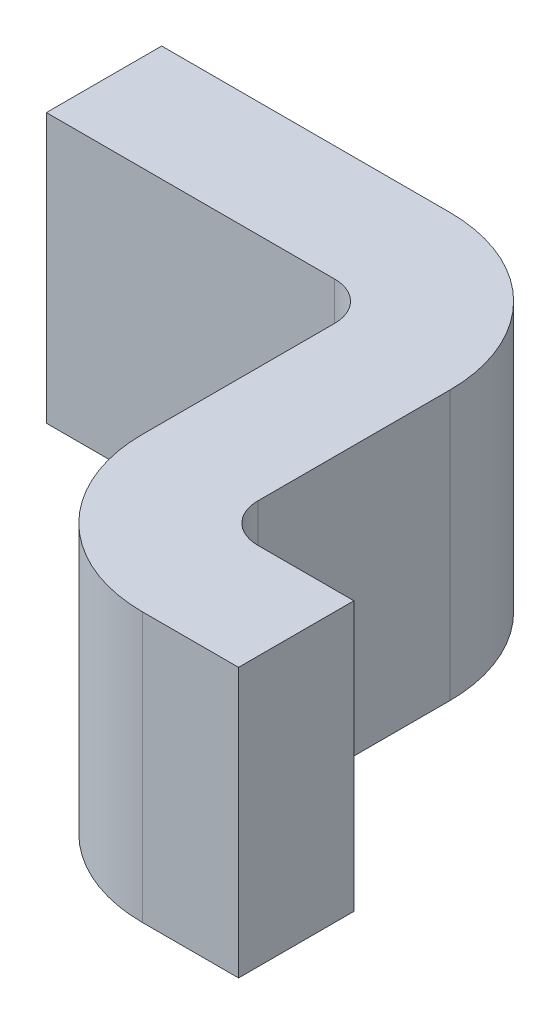
ISO-10303-21;
HEADER;
FILE_DESCRIPTION(('STEP AP214'),'2;1');
FILE_NAME('part.step','',(''),(''),'','','');
FILE_SCHEMA(('AUTOMOTIVE_DESIGN { 1 0 10303 214 1 1 1 1 }'));
ENDSEC;
DATA;
#1=APPLICATION_CONTEXT('core data for automotive mechanical design processes');
#2=APPLICATION_PROTOCOL_DEFINITION('international standard','automotive_design',2000,#1);
#3=PRODUCT_CONTEXT('',#1,'mechanical');
#4=PRODUCT('Part','Part','',(#3));
#5=PRODUCT_RELATED_PRODUCT_CATEGORY('part','',(#4));
#6=PRODUCT_DEFINITION_FORMATION('','',#4);
#7=PRODUCT_DEFINITION_CONTEXT('part definition',#1,'design');
#8=PRODUCT_DEFINITION('design','',#6,#7);
#9=PRODUCT_DEFINITION_SHAPE('','',#8);
#10=(LENGTH_UNIT() NAMED_UNIT(*) SI_UNIT(.MILLI.,.METRE.));
#11=(NAMED_UNIT(*) PLANE_ANGLE_UNIT() SI_UNIT($,.RADIAN.));
#12=(NAMED_UNIT(*) SI_UNIT($,.STERADIAN.) SOLID_ANGLE_UNIT());
#13=UNCERTAINTY_MEASURE_WITH_UNIT(LENGTH_MEASURE(1.E-05),#10,'distance_accuracy_value','');
#14=(GEOMETRIC_REPRESENTATION_CONTEXT(3) GLOBAL_UNCERTAINTY_ASSIGNED_CONTEXT((#13)) GLOBAL_UNIT_ASSIGNED_CONTEXT((#10,
#11,#12)) REPRESENTATION_CONTEXT('',''));
#15=CARTESIAN_POINT('',(0.,0.,0.));
#16=DIRECTION('',(0.,0.,1.));
#17=DIRECTION('',(1.,0.,0.));
#18=AXIS2_PLACEMENT_3D('',#15,#16,#17);
#19=CARTESIAN_POINT('',(-4.075,1.8917811708335,0.));
#20=DIRECTION('',(0.,-1.,0.));
#21=DIRECTION('',(0.,0.,-1.));
#22=AXIS2_PLACEMENT_3D('',#19,#20,#21);
#23=PLANE('',#22);
#24=DIRECTION('',(-1.,0.,0.));
#25=VECTOR('',#24,1.);
#26=CARTESIAN_POINT('',(0.,1.8917811708335,0.));
#27=LINE('',#26,#25);
#28=CARTESIAN_POINT('',(-3.75,1.8917811708335,0.));
#29=VERTEX_POINT('',#28);
#30=CARTESIAN_POINT('',(-4.5,1.8917811708335,0.));
#31=VERTEX_POINT('',#30);
#32=EDGE_CURVE('E134',#29,#31,#27,.T.);
#33=ORIENTED_EDGE('',*,*,#32,.F.);
#34=CARTESIAN_POINT('',(-3.75,1.8917811708335,0.4));
#35=DIRECTION('',(0.,1.,0.));
#36=DIRECTION('',(0.,0.,1.));
#37=AXIS2_PLACEMENT_3D('',#34,#35,#36);
#38=CIRCLE('',#37,0.4);
#39=CARTESIAN_POINT('',(-3.35,1.8917811708335,0.4));
#40=VERTEX_POINT('',#39);
#41=EDGE_CURVE('E182',#40,#29,#38,.T.);
#42=ORIENTED_EDGE('',*,*,#41,.F.);
#43=DIRECTION('',(0.,0.,-1.));
#44=VECTOR('',#43,1.);
#45=CARTESIAN_POINT('',(-3.35,1.8917811708335,0.));
#46=LINE('',#45,#44);
#47=CARTESIAN_POINT('',(-3.35,1.8917811708335,0.9));
#48=VERTEX_POINT('',#47);
#49=EDGE_CURVE('E140',#48,#40,#46,.T.);
#50=ORIENTED_EDGE('',*,*,#49,.F.);
#51=CARTESIAN_POINT('',(-3.25,1.8917811708335,0.9));
#52=DIRECTION('',(0.,-1.,0.));
#53=DIRECTION('',(0.,0.,-1.));
#54=AXIS2_PLACEMENT_3D('',#51,#52,#53);
#55=CIRCLE('',#54,0.1);
#56=CARTESIAN_POINT('',(-3.25,1.8917811708335,1.));
#57=VERTEX_POINT('',#56);
#58=EDGE_CURVE('E185',#48,#57,#55,.F.);
#59=ORIENTED_EDGE('',*,*,#58,.T.);
#60=DIRECTION('',(1.,0.,0.));
#61=VECTOR('',#60,1.);
#62=CARTESIAN_POINT('',(-3.5,1.8917811708335,1.));
#63=LINE('',#62,#61);
#64=CARTESIAN_POINT('',(-3.,1.8917811708335,1.));
#65=VERTEX_POINT('',#64);
#66=EDGE_CURVE('E144',#57,#65,#63,.T.);
#67=ORIENTED_EDGE('',*,*,#66,.T.);
#68=DIRECTION('',(0.,0.,-1.));
#69=VECTOR('',#68,1.);
#70=CARTESIAN_POINT('',(-3.,1.8917811708335,1.));
#71=LINE('',#70,#69);
#72=CARTESIAN_POINT('',(-3.,1.8917811708335,1.3));
#73=VERTEX_POINT('',#72);
#74=EDGE_CURVE('E148',#73,#65,#71,.T.);
#75=ORIENTED_EDGE('',*,*,#74,.F.);
#76=DIRECTION('',(1.,0.,0.));
#77=VECTOR('',#76,1.);
#78=CARTESIAN_POINT('',(-3.65,1.8917811708335,1.3));
#79=LINE('',#78,#77);
#80=CARTESIAN_POINT('',(-3.25,1.8917811708335,1.3));
#81=VERTEX_POINT('',#80);
#82=EDGE_CURVE('E156',#81,#73,#79,.T.);
#83=ORIENTED_EDGE('',*,*,#82,.F.);
#84=CARTESIAN_POINT('',(-3.25,1.8917811708335,0.9));
#85=DIRECTION('',(0.,1.,0.));
#86=DIRECTION('',(0.,0.,1.));
#87=AXIS2_PLACEMENT_3D('',#84,#85,#86);
#88=CIRCLE('',#87,0.4);
#89=CARTESIAN_POINT('',(-3.65,1.8917811708335,0.9));
#90=VERTEX_POINT('',#89);
#91=EDGE_CURVE('E187',#90,#81,#88,.T.);
#92=ORIENTED_EDGE('',*,*,#91,.F.);
#93=DIRECTION('',(0.,0.,-1.));
#94=VECTOR('',#93,1.);
#95=CARTESIAN_POINT('',(-3.65,1.8917811708335,0.15));
#96=LINE('',#95,#94);
#97=CARTESIAN_POINT('',(-3.65,1.8917811708335,0.4));
#98=VERTEX_POINT('',#97);
#99=EDGE_CURVE('E162',#90,#98,#96,.T.);
#100=ORIENTED_EDGE('',*,*,#99,.T.);
#101=CARTESIAN_POINT('',(-3.75,1.8917811708335,0.4));
#102=DIRECTION('',(0.,1.,0.));
#103=DIRECTION('',(0.,0.,1.));
#104=AXIS2_PLACEMENT_3D('',#101,#102,#103);
#105=CIRCLE('',#104,0.1);
#106=CARTESIAN_POINT('',(-3.75,1.8917811708335,0.3));
#107=VERTEX_POINT('',#106);
#108=EDGE_CURVE('E20',#98,#107,#105,.T.);
#109=ORIENTED_EDGE('',*,*,#108,.T.);
#110=DIRECTION('',(-1.,0.,0.));
#111=VECTOR('',#110,1.);
#112=CARTESIAN_POINT('',(0.,1.8917811708335,0.3));
#113=LINE('',#112,#111);
#114=CARTESIAN_POINT('',(-4.5,1.8917811708335,0.3));
#115=VERTEX_POINT('',#114);
#116=EDGE_CURVE('E92',#107,#115,#113,.T.);
#117=ORIENTED_EDGE('',*,*,#116,.T.);
#118=DIRECTION('',(0.,0.,1.));
#119=VECTOR('',#118,1.);
#120=CARTESIAN_POINT('',(-4.5,1.8917811708335,0.));
#121=LINE('',#120,#119);
#122=EDGE_CURVE('E112',#31,#115,#121,.T.);
#123=ORIENTED_EDGE('',*,*,#122,.F.);
#124=EDGE_LOOP('',(#33,#42,#50,#59,#67,#75,#83,#92,#100,#109,#117,#123));
#125=FACE_BOUND('',#124,.T.);
#126=ADVANCED_FACE('F17',(#125),#23,.T.);
#127=CARTESIAN_POINT('',(0.,0.,0.));
#128=DIRECTION('',(0.,0.,-1.));
#129=DIRECTION('',(-1.,0.,0.));
#130=AXIS2_PLACEMENT_3D('',#127,#128,#129);
#131=PLANE('',#130);
#132=DIRECTION('',(0.,1.,0.));
#133=VECTOR('',#132,1.);
#134=CARTESIAN_POINT('',(-4.5,2.2417811708335,0.));
#135=LINE('',#134,#133);
#136=CARTESIAN_POINT('',(-4.5,2.5917811708335,0.));
#137=VERTEX_POINT('',#136);
#138=EDGE_CURVE('E101',#137,#31,#135,.F.);
#139=ORIENTED_EDGE('',*,*,#138,.F.);
#140=DIRECTION('',(1.,0.,0.));
#141=VECTOR('',#140,1.);
#142=CARTESIAN_POINT('',(-4.075,2.5917811708335,0.));
#143=LINE('',#142,#141);
#144=CARTESIAN_POINT('',(-3.75,2.5917811708335,0.));
#145=VERTEX_POINT('',#144);
#146=EDGE_CURVE('E125',#145,#137,#143,.F.);
#147=ORIENTED_EDGE('',*,*,#146,.F.);
#148=DIRECTION('',(0.,1.,0.));
#149=VECTOR('',#148,1.);
#150=CARTESIAN_POINT('',(-3.75,0.,0.));
#151=LINE('',#150,#149);
#152=EDGE_CURVE('E137',#145,#29,#151,.F.);
#153=ORIENTED_EDGE('',*,*,#152,.T.);
#154=ORIENTED_EDGE('',*,*,#32,.T.);
#155=EDGE_LOOP('',(#139,#147,#153,#154));
#156=FACE_BOUND('',#155,.T.);
#157=ADVANCED_FACE('F381',(#156),#131,.T.);
#158=CARTESIAN_POINT('',(-4.5,2.2417811708335,0.));
#159=DIRECTION('',(-1.,0.,0.));
#160=DIRECTION('',(0.,0.,1.));
#161=AXIS2_PLACEMENT_3D('',#158,#159,#160);
#162=PLANE('',#161);
#163=ORIENTED_EDGE('',*,*,#138,.T.);
#164=ORIENTED_EDGE('',*,*,#122,.T.);
#165=DIRECTION('',(0.,1.,0.));
#166=VECTOR('',#165,1.);
#167=CARTESIAN_POINT('',(-4.5,0.,0.3));
#168=LINE('',#167,#166);
#169=CARTESIAN_POINT('',(-4.5,2.5917811708335,0.3));
#170=VERTEX_POINT('',#169);
#171=EDGE_CURVE('E106',#115,#170,#168,.T.);
#172=ORIENTED_EDGE('',*,*,#171,.T.);
#173=DIRECTION('',(0.,0.,1.));
#174=VECTOR('',#173,1.);
#175=CARTESIAN_POINT('',(-4.5,2.5917811708335,0.));
#176=LINE('',#175,#174);
#177=EDGE_CURVE('E110',#137,#170,#176,.T.);
#178=ORIENTED_EDGE('',*,*,#177,.F.);
#179=EDGE_LOOP('',(#163,#164,#172,#178));
#180=FACE_BOUND('',#179,.T.);
#181=ADVANCED_FACE('F108',(#180),#162,.T.);
#182=CARTESIAN_POINT('',(0.,0.,0.3));
#183=DIRECTION('',(0.,0.,-1.));
#184=DIRECTION('',(-1.,0.,0.));
#185=AXIS2_PLACEMENT_3D('',#182,#183,#184);
#186=PLANE('',#185);
#187=DIRECTION('',(1.,0.,0.));
#188=VECTOR('',#187,1.);
#189=CARTESIAN_POINT('',(-4.075,2.5917811708335,0.3));
#190=LINE('',#189,#188);
#191=CARTESIAN_POINT('',(-3.75,2.5917811708335,0.3));
#192=VERTEX_POINT('',#191);
#193=EDGE_CURVE('E117',#170,#192,#190,.T.);
#194=ORIENTED_EDGE('',*,*,#193,.F.);
#195=ORIENTED_EDGE('',*,*,#171,.F.);
#196=ORIENTED_EDGE('',*,*,#116,.F.);
#197=DIRECTION('',(0.,1.,0.));
#198=VECTOR('',#197,1.);
#199=CARTESIAN_POINT('',(-3.75,1.12089058541675,0.3));
#200=LINE('',#199,#198);
#201=EDGE_CURVE('E114',#107,#192,#200,.T.);
#202=ORIENTED_EDGE('',*,*,#201,.T.);
#203=EDGE_LOOP('',(#194,#195,#196,#202));
#204=FACE_BOUND('',#203,.T.);
#205=ADVANCED_FACE('F118',(#204),#186,.F.);
#206=CARTESIAN_POINT('',(-3.75,1.12089058541675,0.4));
#207=DIRECTION('',(0.,1.,0.));
#208=DIRECTION('',(0.,0.,1.));
#209=AXIS2_PLACEMENT_3D('',#206,#207,#208);
#210=CYLINDRICAL_SURFACE('',#209,0.1);
#211=ORIENTED_EDGE('',*,*,#108,.F.);
#212=DIRECTION('',(0.,1.,0.));
#213=VECTOR('',#212,1.);
#214=CARTESIAN_POINT('',(-3.65,2.2417811708335,0.4));
#215=LINE('',#214,#213);
#216=CARTESIAN_POINT('',(-3.65,2.5917811708335,0.4));
#217=VERTEX_POINT('',#216);
#218=EDGE_CURVE('E164',#98,#217,#215,.T.);
#219=ORIENTED_EDGE('',*,*,#218,.T.);
#220=CARTESIAN_POINT('',(-3.75,2.5917811708335,0.4));
#221=DIRECTION('',(0.,1.,0.));
#222=DIRECTION('',(0.,0.,1.));
#223=AXIS2_PLACEMENT_3D('',#220,#221,#222);
#224=CIRCLE('',#223,0.1);
#225=EDGE_CURVE('E122',#192,#217,#224,.F.);
#226=ORIENTED_EDGE('',*,*,#225,.F.);
#227=ORIENTED_EDGE('',*,*,#201,.F.);
#228=EDGE_LOOP('',(#211,#219,#226,#227));
#229=FACE_BOUND('',#228,.T.);
#230=ADVANCED_FACE('F262',(#229),#210,.F.);
#231=CARTESIAN_POINT('',(-3.65,2.2417811708335,0.15));
#232=DIRECTION('',(1.,0.,0.));
#233=DIRECTION('',(0.,0.,-1.));
#234=AXIS2_PLACEMENT_3D('',#231,#232,#233);
#235=PLANE('',#234);
#236=ORIENTED_EDGE('',*,*,#99,.F.);
#237=DIRECTION('',(0.,1.,0.));
#238=VECTOR('',#237,1.);
#239=CARTESIAN_POINT('',(-3.65,2.2417811708335,0.9));
#240=LINE('',#239,#238);
#241=CARTESIAN_POINT('',(-3.65,2.5917811708335,0.9));
#242=VERTEX_POINT('',#241);
#243=EDGE_CURVE('E188',#242,#90,#240,.F.);
#244=ORIENTED_EDGE('',*,*,#243,.F.);
#245=DIRECTION('',(0.,0.,1.));
#246=VECTOR('',#245,1.);
#247=CARTESIAN_POINT('',(-3.65,2.5917811708335,0.));
#248=LINE('',#247,#246);
#249=EDGE_CURVE('E179',#217,#242,#248,.T.);
#250=ORIENTED_EDGE('',*,*,#249,.F.);
#251=ORIENTED_EDGE('',*,*,#218,.F.);
#252=EDGE_LOOP('',(#236,#244,#250,#251));
#253=FACE_BOUND('',#252,.T.);
#254=ADVANCED_FACE('F254',(#253),#235,.F.);
#255=CARTESIAN_POINT('',(-3.25,2.2417811708335,0.9));
#256=DIRECTION('',(0.,1.,0.));
#257=DIRECTION('',(0.,0.,1.));
#258=AXIS2_PLACEMENT_3D('',#255,#256,#257);
#259=CYLINDRICAL_SURFACE('',#258,0.4);
#260=DIRECTION('',(0.,1.,0.));
#261=VECTOR('',#260,1.);
#262=CARTESIAN_POINT('',(-3.25,2.2417811708335,1.3));
#263=LINE('',#262,#261);
#264=CARTESIAN_POINT('',(-3.25,2.5917811708335,1.3));
#265=VERTEX_POINT('',#264);
#266=EDGE_CURVE('E159',#265,#81,#263,.F.);
#267=ORIENTED_EDGE('',*,*,#266,.F.);
#268=CARTESIAN_POINT('',(-3.25,2.5917811708335,0.9));
#269=DIRECTION('',(0.,1.,0.));
#270=DIRECTION('',(0.,0.,1.));
#271=AXIS2_PLACEMENT_3D('',#268,#269,#270);
#272=CIRCLE('',#271,0.4);
#273=EDGE_CURVE('E176',#242,#265,#272,.T.);
#274=ORIENTED_EDGE('',*,*,#273,.F.);
#275=ORIENTED_EDGE('',*,*,#243,.T.);
#276=ORIENTED_EDGE('',*,*,#91,.T.);
#277=EDGE_LOOP('',(#267,#274,#275,#276));
#278=FACE_BOUND('',#277,.T.);
#279=ADVANCED_FACE('F252',(#278),#259,.T.);
#280=CARTESIAN_POINT('',(-3.65,2.2417811708335,1.3));
#281=DIRECTION('',(0.,0.,1.));
#282=DIRECTION('',(1.,0.,0.));
#283=AXIS2_PLACEMENT_3D('',#280,#281,#282);
#284=PLANE('',#283);
#285=DIRECTION('',(0.,1.,0.));
#286=VECTOR('',#285,1.);
#287=CARTESIAN_POINT('',(-3.,2.2417811708335,1.3));
#288=LINE('',#287,#286);
#289=CARTESIAN_POINT('',(-3.,2.5917811708335,1.3));
#290=VERTEX_POINT('',#289);
#291=EDGE_CURVE('E153',#290,#73,#288,.F.);
#292=ORIENTED_EDGE('',*,*,#291,.F.);
#293=DIRECTION('',(1.,0.,0.));
#294=VECTOR('',#293,1.);
#295=CARTESIAN_POINT('',(-4.075,2.5917811708335,1.3));
#296=LINE('',#295,#294);
#297=EDGE_CURVE('E178',#265,#290,#296,.T.);
#298=ORIENTED_EDGE('',*,*,#297,.F.);
#299=ORIENTED_EDGE('',*,*,#266,.T.);
#300=ORIENTED_EDGE('',*,*,#82,.T.);
#301=EDGE_LOOP('',(#292,#298,#299,#300));
#302=FACE_BOUND('',#301,.T.);
#303=ADVANCED_FACE('F247',(#302),#284,.T.);
#304=CARTESIAN_POINT('',(-3.,2.2417811708335,1.));
#305=DIRECTION('',(1.,0.,0.));
#306=DIRECTION('',(0.,0.,-1.));
#307=AXIS2_PLACEMENT_3D('',#304,#305,#306);
#308=PLANE('',#307);
#309=DIRECTION('',(0.,1.,0.));
#310=VECTOR('',#309,1.);
#311=CARTESIAN_POINT('',(-3.,2.2417811708335,1.));
#312=LINE('',#311,#310);
#313=CARTESIAN_POINT('',(-3.,2.5917811708335,1.));
#314=VERTEX_POINT('',#313);
#315=EDGE_CURVE('E147',#65,#314,#312,.T.);
#316=ORIENTED_EDGE('',*,*,#315,.T.);
#317=DIRECTION('',(0.,0.,1.));
#318=VECTOR('',#317,1.);
#319=CARTESIAN_POINT('',(-3.,2.5917811708335,0.));
#320=LINE('',#319,#318);
#321=EDGE_CURVE('E207',#290,#314,#320,.F.);
#322=ORIENTED_EDGE('',*,*,#321,.F.);
#323=ORIENTED_EDGE('',*,*,#291,.T.);
#324=ORIENTED_EDGE('',*,*,#74,.T.);
#325=EDGE_LOOP('',(#316,#322,#323,#324));
#326=FACE_BOUND('',#325,.T.);
#327=ADVANCED_FACE('F250',(#326),#308,.T.);
#328=CARTESIAN_POINT('',(-3.5,2.2417811708335,1.));
#329=DIRECTION('',(0.,0.,1.));
#330=DIRECTION('',(1.,0.,0.));
#331=AXIS2_PLACEMENT_3D('',#328,#329,#330);
#332=PLANE('',#331);
#333=DIRECTION('',(1.,0.,0.));
#334=VECTOR('',#333,1.);
#335=CARTESIAN_POINT('',(-4.075,2.5917811708335,1.));
#336=LINE('',#335,#334);
#337=CARTESIAN_POINT('',(-3.25,2.5917811708335,1.));
#338=VERTEX_POINT('',#337);
#339=EDGE_CURVE('E175',#314,#338,#336,.F.);
#340=ORIENTED_EDGE('',*,*,#339,.F.);
#341=ORIENTED_EDGE('',*,*,#315,.F.);
#342=ORIENTED_EDGE('',*,*,#66,.F.);
#343=DIRECTION('',(0.,-1.,0.));
#344=VECTOR('',#343,1.);
#345=CARTESIAN_POINT('',(-3.25,2.2417811708335,1.));
#346=LINE('',#345,#344);
#347=EDGE_CURVE('E186',#57,#338,#346,.F.);
#348=ORIENTED_EDGE('',*,*,#347,.T.);
#349=EDGE_LOOP('',(#340,#341,#342,#348));
#350=FACE_BOUND('',#349,.T.);
#351=ADVANCED_FACE('F237',(#350),#332,.F.);
#352=CARTESIAN_POINT('',(-3.25,2.2417811708335,0.9));
#353=DIRECTION('',(0.,-1.,0.));
#354=DIRECTION('',(0.,0.,-1.));
#355=AXIS2_PLACEMENT_3D('',#352,#353,#354);
#356=CYLINDRICAL_SURFACE('',#355,0.1);
#357=ORIENTED_EDGE('',*,*,#58,.F.);
#358=DIRECTION('',(0.,1.,0.));
#359=VECTOR('',#358,1.);
#360=CARTESIAN_POINT('',(-3.35,2.2417811708335,0.9));
#361=LINE('',#360,#359);
#362=CARTESIAN_POINT('',(-3.35,2.5917811708335,0.9));
#363=VERTEX_POINT('',#362);
#364=EDGE_CURVE('E143',#363,#48,#361,.F.);
#365=ORIENTED_EDGE('',*,*,#364,.F.);
#366=CARTESIAN_POINT('',(-3.25,2.5917811708335,0.9));
#367=DIRECTION('',(0.,-1.,0.));
#368=DIRECTION('',(0.,0.,-1.));
#369=AXIS2_PLACEMENT_3D('',#366,#367,#368);
#370=CIRCLE('',#369,0.1);
#371=EDGE_CURVE('E26',#338,#363,#370,.T.);
#372=ORIENTED_EDGE('',*,*,#371,.F.);
#373=ORIENTED_EDGE('',*,*,#347,.F.);
#374=EDGE_LOOP('',(#357,#365,#372,#373));
#375=FACE_BOUND('',#374,.T.);
#376=ADVANCED_FACE('F276',(#375),#356,.F.);
#377=CARTESIAN_POINT('',(-3.35,2.2417811708335,0.));
#378=DIRECTION('',(1.,0.,0.));
#379=DIRECTION('',(0.,0.,-1.));
#380=AXIS2_PLACEMENT_3D('',#377,#378,#379);
#381=PLANE('',#380);
#382=ORIENTED_EDGE('',*,*,#364,.T.);
#383=ORIENTED_EDGE('',*,*,#49,.T.);
#384=DIRECTION('',(0.,1.,0.));
#385=VECTOR('',#384,1.);
#386=CARTESIAN_POINT('',(-3.35,1.12089058541675,0.4));
#387=LINE('',#386,#385);
#388=CARTESIAN_POINT('',(-3.35,2.5917811708335,0.4));
#389=VERTEX_POINT('',#388);
#390=EDGE_CURVE('E142',#389,#40,#387,.F.);
#391=ORIENTED_EDGE('',*,*,#390,.F.);
#392=DIRECTION('',(0.,0.,1.));
#393=VECTOR('',#392,1.);
#394=CARTESIAN_POINT('',(-3.35,2.5917811708335,0.));
#395=LINE('',#394,#393);
#396=EDGE_CURVE('E11',#363,#389,#395,.F.);
#397=ORIENTED_EDGE('',*,*,#396,.F.);
#398=EDGE_LOOP('',(#382,#383,#391,#397));
#399=FACE_BOUND('',#398,.T.);
#400=ADVANCED_FACE('F271',(#399),#381,.T.);
#401=CARTESIAN_POINT('',(-3.75,1.12089058541675,0.4));
#402=DIRECTION('',(0.,1.,0.));
#403=DIRECTION('',(0.,0.,1.));
#404=AXIS2_PLACEMENT_3D('',#401,#402,#403);
#405=CYLINDRICAL_SURFACE('',#404,0.4);
#406=ORIENTED_EDGE('',*,*,#390,.T.);
#407=ORIENTED_EDGE('',*,*,#41,.T.);
#408=ORIENTED_EDGE('',*,*,#152,.F.);
#409=CARTESIAN_POINT('',(-3.75,2.5917811708335,0.4));
#410=DIRECTION('',(0.,1.,0.));
#411=DIRECTION('',(0.,0.,1.));
#412=AXIS2_PLACEMENT_3D('',#409,#410,#411);
#413=CIRCLE('',#412,0.4);
#414=EDGE_CURVE('E35',#389,#145,#413,.T.);
#415=ORIENTED_EDGE('',*,*,#414,.F.);
#416=EDGE_LOOP('',(#406,#407,#408,#415));
#417=FACE_BOUND('',#416,.T.);
#418=ADVANCED_FACE('F266',(#417),#405,.T.);
#419=CARTESIAN_POINT('',(-4.075,2.5917811708335,0.));
#420=DIRECTION('',(0.,1.,0.));
#421=DIRECTION('',(0.,0.,1.));
#422=AXIS2_PLACEMENT_3D('',#419,#420,#421);
#423=PLANE('',#422);
#424=ORIENTED_EDGE('',*,*,#396,.T.);
#425=ORIENTED_EDGE('',*,*,#414,.T.);
#426=ORIENTED_EDGE('',*,*,#146,.T.);
#427=ORIENTED_EDGE('',*,*,#177,.T.);
#428=ORIENTED_EDGE('',*,*,#193,.T.);
#429=ORIENTED_EDGE('',*,*,#225,.T.);
#430=ORIENTED_EDGE('',*,*,#249,.T.);
#431=ORIENTED_EDGE('',*,*,#273,.T.);
#432=ORIENTED_EDGE('',*,*,#297,.T.);
#433=ORIENTED_EDGE('',*,*,#321,.T.);
#434=ORIENTED_EDGE('',*,*,#339,.T.);
#435=ORIENTED_EDGE('',*,*,#371,.T.);
#436=EDGE_LOOP('',(#424,#425,#426,#427,#428,#429,#430,#431,#432,#433,#434,#435));
#437=FACE_BOUND('',#436,.T.);
#438=ADVANCED_FACE('F124',(#437),#423,.T.);
#439=CLOSED_SHELL('',(#126,#157,#181,#205,#230,#254,#279,#303,#327,#351,#376,#400,#418,#438));
#440=MANIFOLD_SOLID_BREP('B1',#439);
#441=ADVANCED_BREP_SHAPE_REPRESENTATION('',(#18,#440),#14);
#442=SHAPE_DEFINITION_REPRESENTATION(#9,#441);
ENDSEC;
END-ISO-10303-21;
